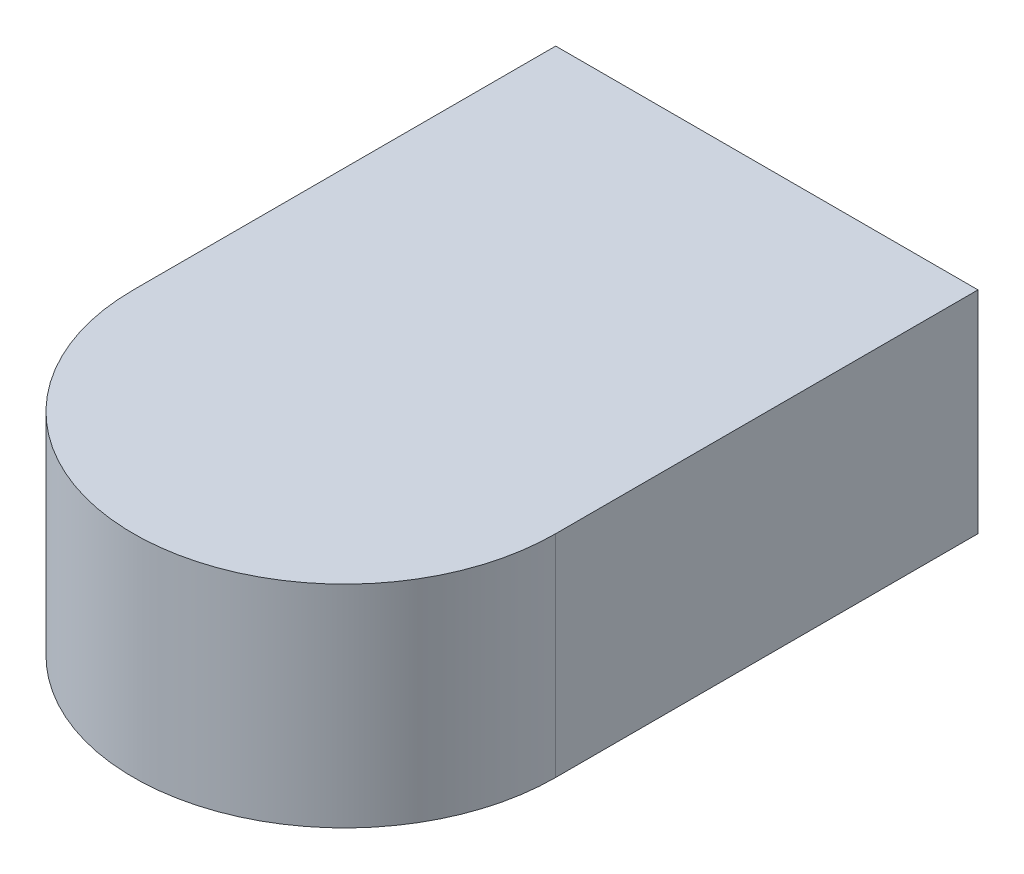
ISO-10303-21;
HEADER;
FILE_DESCRIPTION(('STEP AP214'),'2;1');
FILE_NAME('part.step','',(''),(''),'','','');
FILE_SCHEMA(('AUTOMOTIVE_DESIGN { 1 0 10303 214 1 1 1 1 }'));
ENDSEC;
DATA;
#1=APPLICATION_CONTEXT('core data for automotive mechanical design processes');
#2=APPLICATION_PROTOCOL_DEFINITION('international standard','automotive_design',2000,#1);
#3=PRODUCT_CONTEXT('',#1,'mechanical');
#4=PRODUCT('Part','Part','',(#3));
#5=PRODUCT_RELATED_PRODUCT_CATEGORY('part','',(#4));
#6=PRODUCT_DEFINITION_FORMATION('','',#4);
#7=PRODUCT_DEFINITION_CONTEXT('part definition',#1,'design');
#8=PRODUCT_DEFINITION('design','',#6,#7);
#9=PRODUCT_DEFINITION_SHAPE('','',#8);
#10=(LENGTH_UNIT() NAMED_UNIT(*) SI_UNIT(.MILLI.,.METRE.));
#11=(NAMED_UNIT(*) PLANE_ANGLE_UNIT() SI_UNIT($,.RADIAN.));
#12=(NAMED_UNIT(*) SI_UNIT($,.STERADIAN.) SOLID_ANGLE_UNIT());
#13=UNCERTAINTY_MEASURE_WITH_UNIT(LENGTH_MEASURE(1.E-05),#10,'distance_accuracy_value','');
#14=(GEOMETRIC_REPRESENTATION_CONTEXT(3) GLOBAL_UNCERTAINTY_ASSIGNED_CONTEXT((#13)) GLOBAL_UNIT_ASSIGNED_CONTEXT((#10,
#11,#12)) REPRESENTATION_CONTEXT('',''));
#15=CARTESIAN_POINT('',(0.,0.,0.));
#16=DIRECTION('',(0.,0.,1.));
#17=DIRECTION('',(1.,0.,0.));
#18=AXIS2_PLACEMENT_3D('',#15,#16,#17);
#19=CARTESIAN_POINT('',(0.,0.,0.));
#20=DIRECTION('',(0.,1.,0.));
#21=DIRECTION('',(1.,0.,0.));
#22=AXIS2_PLACEMENT_3D('',#19,#20,#21);
#23=PLANE('',#22);
#24=DIRECTION('',(-1.,0.,0.));
#25=VECTOR('',#24,1.);
#26=CARTESIAN_POINT('',(0.5,0.,-2.25));
#27=LINE('',#26,#25);
#28=CARTESIAN_POINT('',(0.5,0.,-2.25));
#29=VERTEX_POINT('',#28);
#30=CARTESIAN_POINT('',(0.3,0.,-2.25));
#31=VERTEX_POINT('',#30);
#32=EDGE_CURVE('E11',#29,#31,#27,.T.);
#33=ORIENTED_EDGE('',*,*,#32,.F.);
#34=DIRECTION('',(0.,0.,-1.));
#35=VECTOR('',#34,1.);
#36=CARTESIAN_POINT('',(0.5,0.,-2.05));
#37=LINE('',#36,#35);
#38=CARTESIAN_POINT('',(0.5,0.,-2.05));
#39=VERTEX_POINT('',#38);
#40=EDGE_CURVE('E25',#39,#29,#37,.T.);
#41=ORIENTED_EDGE('',*,*,#40,.F.);
#42=CARTESIAN_POINT('',(0.4,0.,-2.05));
#43=DIRECTION('',(0.,1.,0.));
#44=DIRECTION('',(-1.,0.,0.));
#45=AXIS2_PLACEMENT_3D('',#42,#43,#44);
#46=CIRCLE('',#45,0.1);
#47=CARTESIAN_POINT('',(0.3,0.,-2.05));
#48=VERTEX_POINT('',#47);
#49=EDGE_CURVE('E73',#48,#39,#46,.T.);
#50=ORIENTED_EDGE('',*,*,#49,.F.);
#51=DIRECTION('',(0.,0.,1.));
#52=VECTOR('',#51,1.);
#53=CARTESIAN_POINT('',(0.3,0.,-2.25));
#54=LINE('',#53,#52);
#55=EDGE_CURVE('E99',#31,#48,#54,.T.);
#56=ORIENTED_EDGE('',*,*,#55,.F.);
#57=EDGE_LOOP('',(#33,#41,#50,#56));
#58=FACE_BOUND('',#57,.T.);
#59=ADVANCED_FACE('F17',(#58),#23,.F.);
#60=CARTESIAN_POINT('',(0.3,0.,-2.25));
#61=DIRECTION('',(-1.,0.,0.));
#62=DIRECTION('',(0.,0.,1.));
#63=AXIS2_PLACEMENT_3D('',#60,#61,#62);
#64=PLANE('',#63);
#65=DIRECTION('',(0.,1.,0.));
#66=VECTOR('',#65,1.);
#67=CARTESIAN_POINT('',(0.3,0.,-2.05));
#68=LINE('',#67,#66);
#69=CARTESIAN_POINT('',(0.3,0.1,-2.05));
#70=VERTEX_POINT('',#69);
#71=EDGE_CURVE('E95',#48,#70,#68,.T.);
#72=ORIENTED_EDGE('',*,*,#71,.T.);
#73=DIRECTION('',(0.,0.,1.));
#74=VECTOR('',#73,1.);
#75=CARTESIAN_POINT('',(0.3,0.1,-2.25));
#76=LINE('',#75,#74);
#77=CARTESIAN_POINT('',(0.3,0.1,-2.25));
#78=VERTEX_POINT('',#77);
#79=EDGE_CURVE('E68',#78,#70,#76,.T.);
#80=ORIENTED_EDGE('',*,*,#79,.F.);
#81=DIRECTION('',(0.,1.,0.));
#82=VECTOR('',#81,1.);
#83=CARTESIAN_POINT('',(0.3,0.,-2.25));
#84=LINE('',#83,#82);
#85=EDGE_CURVE('E87',#31,#78,#84,.T.);
#86=ORIENTED_EDGE('',*,*,#85,.F.);
#87=ORIENTED_EDGE('',*,*,#55,.T.);
#88=EDGE_LOOP('',(#72,#80,#86,#87));
#89=FACE_BOUND('',#88,.T.);
#90=ADVANCED_FACE('F113',(#89),#64,.T.);
#91=CARTESIAN_POINT('',(0.5,0.,-2.25));
#92=DIRECTION('',(0.,0.,-1.));
#93=DIRECTION('',(-1.,0.,0.));
#94=AXIS2_PLACEMENT_3D('',#91,#92,#93);
#95=PLANE('',#94);
#96=ORIENTED_EDGE('',*,*,#85,.T.);
#97=DIRECTION('',(-1.,0.,0.));
#98=VECTOR('',#97,1.);
#99=CARTESIAN_POINT('',(0.5,0.1,-2.25));
#100=LINE('',#99,#98);
#101=CARTESIAN_POINT('',(0.5,0.1,-2.25));
#102=VERTEX_POINT('',#101);
#103=EDGE_CURVE('E83',#102,#78,#100,.T.);
#104=ORIENTED_EDGE('',*,*,#103,.F.);
#105=DIRECTION('',(0.,1.,0.));
#106=VECTOR('',#105,1.);
#107=CARTESIAN_POINT('',(0.5,0.,-2.25));
#108=LINE('',#107,#106);
#109=EDGE_CURVE('E60',#29,#102,#108,.T.);
#110=ORIENTED_EDGE('',*,*,#109,.F.);
#111=ORIENTED_EDGE('',*,*,#32,.T.);
#112=EDGE_LOOP('',(#96,#104,#110,#111));
#113=FACE_BOUND('',#112,.T.);
#114=ADVANCED_FACE('F119',(#113),#95,.T.);
#115=CARTESIAN_POINT('',(0.5,0.,-2.05));
#116=DIRECTION('',(1.,0.,0.));
#117=DIRECTION('',(0.,0.,-1.));
#118=AXIS2_PLACEMENT_3D('',#115,#116,#117);
#119=PLANE('',#118);
#120=ORIENTED_EDGE('',*,*,#109,.T.);
#121=DIRECTION('',(0.,0.,-1.));
#122=VECTOR('',#121,1.);
#123=CARTESIAN_POINT('',(0.5,0.1,-2.05));
#124=LINE('',#123,#122);
#125=CARTESIAN_POINT('',(0.5,0.1,-2.05));
#126=VERTEX_POINT('',#125);
#127=EDGE_CURVE('E54',#126,#102,#124,.T.);
#128=ORIENTED_EDGE('',*,*,#127,.F.);
#129=DIRECTION('',(0.,1.,0.));
#130=VECTOR('',#129,1.);
#131=CARTESIAN_POINT('',(0.5,0.,-2.05));
#132=LINE('',#131,#130);
#133=EDGE_CURVE('E58',#39,#126,#132,.T.);
#134=ORIENTED_EDGE('',*,*,#133,.F.);
#135=ORIENTED_EDGE('',*,*,#40,.T.);
#136=EDGE_LOOP('',(#120,#128,#134,#135));
#137=FACE_BOUND('',#136,.T.);
#138=ADVANCED_FACE('F56',(#137),#119,.T.);
#139=CARTESIAN_POINT('',(0.4,0.,-2.05));
#140=DIRECTION('',(0.,1.,0.));
#141=DIRECTION('',(0.,0.,-1.));
#142=AXIS2_PLACEMENT_3D('',#139,#140,#141);
#143=CYLINDRICAL_SURFACE('',#142,0.1);
#144=ORIENTED_EDGE('',*,*,#133,.T.);
#145=CARTESIAN_POINT('',(0.4,0.1,-2.05));
#146=DIRECTION('',(0.,1.,0.));
#147=DIRECTION('',(-1.,0.,0.));
#148=AXIS2_PLACEMENT_3D('',#145,#146,#147);
#149=CIRCLE('',#148,0.1);
#150=EDGE_CURVE('E66',#70,#126,#149,.T.);
#151=ORIENTED_EDGE('',*,*,#150,.F.);
#152=ORIENTED_EDGE('',*,*,#71,.F.);
#153=ORIENTED_EDGE('',*,*,#49,.T.);
#154=EDGE_LOOP('',(#144,#151,#152,#153));
#155=FACE_BOUND('',#154,.T.);
#156=ADVANCED_FACE('F72',(#155),#143,.T.);
#157=CARTESIAN_POINT('',(0.,0.1,0.));
#158=DIRECTION('',(0.,1.,0.));
#159=DIRECTION('',(1.,0.,0.));
#160=AXIS2_PLACEMENT_3D('',#157,#158,#159);
#161=PLANE('',#160);
#162=ORIENTED_EDGE('',*,*,#150,.T.);
#163=ORIENTED_EDGE('',*,*,#127,.T.);
#164=ORIENTED_EDGE('',*,*,#103,.T.);
#165=ORIENTED_EDGE('',*,*,#79,.T.);
#166=EDGE_LOOP('',(#162,#163,#164,#165));
#167=FACE_BOUND('',#166,.T.);
#168=ADVANCED_FACE('F67',(#167),#161,.T.);
#169=CLOSED_SHELL('',(#59,#90,#114,#138,#156,#168));
#170=MANIFOLD_SOLID_BREP('B1',#169);
#171=ADVANCED_BREP_SHAPE_REPRESENTATION('',(#18,#170),#14);
#172=SHAPE_DEFINITION_REPRESENTATION(#9,#171);
ENDSEC;
END-ISO-10303-21;
